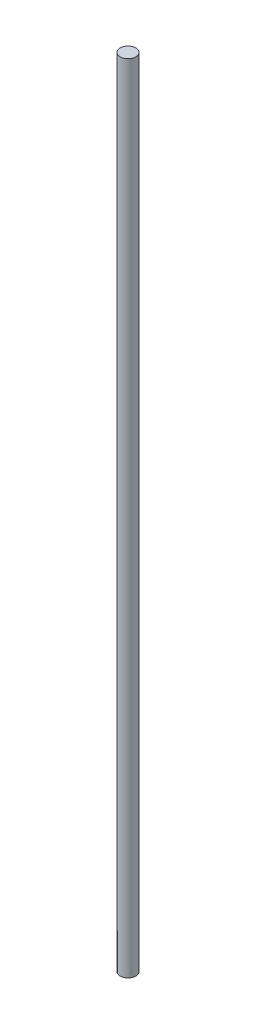
ISO-10303-21;
HEADER;
FILE_DESCRIPTION(('STEP AP214'),'2;1');
FILE_NAME('part.step','',(''),(''),'','','');
FILE_SCHEMA(('AUTOMOTIVE_DESIGN { 1 0 10303 214 1 1 1 1 }'));
ENDSEC;
DATA;
#1=APPLICATION_CONTEXT('core data for automotive mechanical design processes');
#2=APPLICATION_PROTOCOL_DEFINITION('international standard','automotive_design',2000,#1);
#3=PRODUCT_CONTEXT('',#1,'mechanical');
#4=PRODUCT('Part','Part','',(#3));
#5=PRODUCT_RELATED_PRODUCT_CATEGORY('part','',(#4));
#6=PRODUCT_DEFINITION_FORMATION('','',#4);
#7=PRODUCT_DEFINITION_CONTEXT('part definition',#1,'design');
#8=PRODUCT_DEFINITION('design','',#6,#7);
#9=PRODUCT_DEFINITION_SHAPE('','',#8);
#10=(LENGTH_UNIT() NAMED_UNIT(*) SI_UNIT(.MILLI.,.METRE.));
#11=(NAMED_UNIT(*) PLANE_ANGLE_UNIT() SI_UNIT($,.RADIAN.));
#12=(NAMED_UNIT(*) SI_UNIT($,.STERADIAN.) SOLID_ANGLE_UNIT());
#13=UNCERTAINTY_MEASURE_WITH_UNIT(LENGTH_MEASURE(1.E-05),#10,'distance_accuracy_value','');
#14=(GEOMETRIC_REPRESENTATION_CONTEXT(3) GLOBAL_UNCERTAINTY_ASSIGNED_CONTEXT((#13)) GLOBAL_UNIT_ASSIGNED_CONTEXT((#10,
#11,#12)) REPRESENTATION_CONTEXT('',''));
#15=CARTESIAN_POINT('',(0.,0.,0.));
#16=DIRECTION('',(0.,0.,1.));
#17=DIRECTION('',(1.,0.,0.));
#18=AXIS2_PLACEMENT_3D('',#15,#16,#17);
#19=CARTESIAN_POINT('',(0.,204.,0.));
#20=DIRECTION('',(0.,-1.,0.));
#21=DIRECTION('',(0.,0.,-1.));
#22=AXIS2_PLACEMENT_3D('',#19,#20,#21);
#23=CYLINDRICAL_SURFACE('',#22,4.);
#24=CARTESIAN_POINT('',(0.,204.,0.));
#25=DIRECTION('',(0.,-1.,0.));
#26=DIRECTION('',(0.,0.,-1.));
#27=AXIS2_PLACEMENT_3D('',#24,#25,#26);
#28=CIRCLE('',#27,4.);
#29=CARTESIAN_POINT('',(0.,204.,-4.));
#30=VERTEX_POINT('',#29);
#31=EDGE_CURVE('E10',#30,#30,#28,.T.);
#32=ORIENTED_EDGE('',*,*,#31,.T.);
#33=EDGE_LOOP('',(#32));
#34=FACE_BOUND('',#33,.T.);
#35=CARTESIAN_POINT('',(0.,-204.,0.));
#36=DIRECTION('',(0.,-1.,0.));
#37=DIRECTION('',(0.,0.,-1.));
#38=AXIS2_PLACEMENT_3D('',#35,#36,#37);
#39=CIRCLE('',#38,4.);
#40=CARTESIAN_POINT('',(0.,-204.,-4.));
#41=VERTEX_POINT('',#40);
#42=EDGE_CURVE('E38',#41,#41,#39,.T.);
#43=ORIENTED_EDGE('',*,*,#42,.F.);
#44=EDGE_LOOP('',(#43));
#45=FACE_BOUND('',#44,.T.);
#46=ADVANCED_FACE('F32',(#34,#45),#23,.T.);
#47=CARTESIAN_POINT('',(4.,204.,0.));
#48=DIRECTION('',(0.,1.,0.));
#49=DIRECTION('',(0.,0.,1.));
#50=AXIS2_PLACEMENT_3D('',#47,#48,#49);
#51=PLANE('',#50);
#52=ORIENTED_EDGE('',*,*,#31,.F.);
#53=EDGE_LOOP('',(#52));
#54=FACE_BOUND('',#53,.T.);
#55=ADVANCED_FACE('F47',(#54),#51,.T.);
#56=CARTESIAN_POINT('',(0.,-204.,0.));
#57=DIRECTION('',(0.,-1.,0.));
#58=DIRECTION('',(0.,0.,-1.));
#59=AXIS2_PLACEMENT_3D('',#56,#57,#58);
#60=PLANE('',#59);
#61=ORIENTED_EDGE('',*,*,#42,.T.);
#62=EDGE_LOOP('',(#61));
#63=FACE_BOUND('',#62,.T.);
#64=ADVANCED_FACE('F44',(#63),#60,.T.);
#65=CLOSED_SHELL('',(#46,#55,#64));
#66=MANIFOLD_SOLID_BREP('B2',#65);
#67=ADVANCED_BREP_SHAPE_REPRESENTATION('',(#18,#66),#14);
#68=SHAPE_DEFINITION_REPRESENTATION(#9,#67);
ENDSEC;
END-ISO-10303-21;
